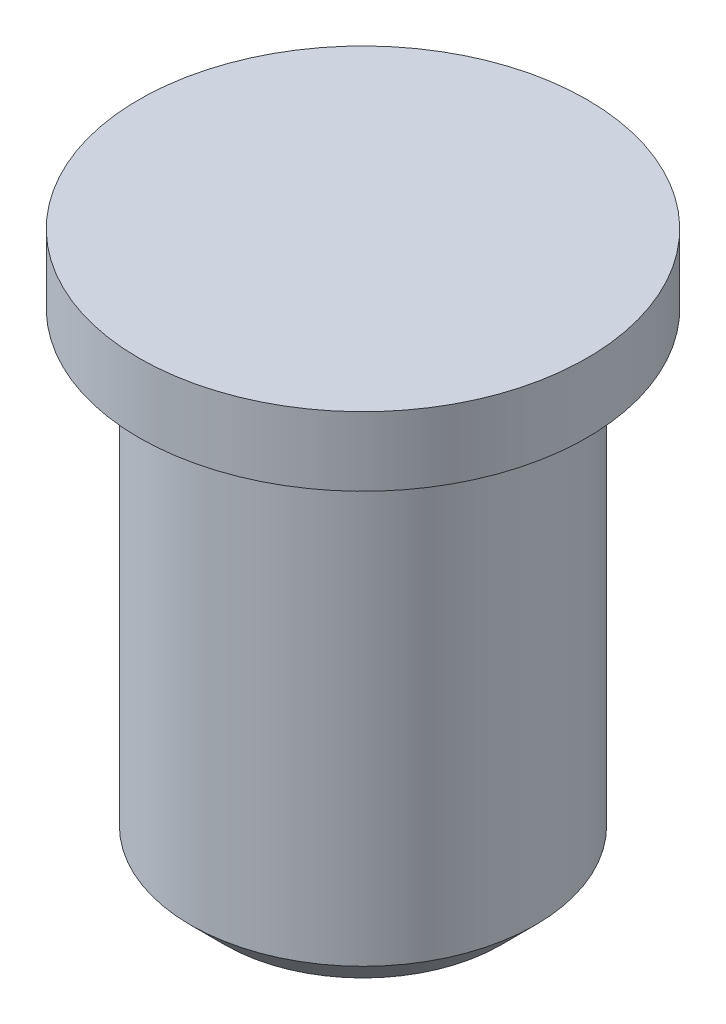
ISO-10303-21;
HEADER;
FILE_DESCRIPTION(('STEP AP214'),'2;1');
FILE_NAME('part.step','',(''),(''),'','','');
FILE_SCHEMA(('AUTOMOTIVE_DESIGN { 1 0 10303 214 1 1 1 1 }'));
ENDSEC;
DATA;
#1=APPLICATION_CONTEXT('core data for automotive mechanical design processes');
#2=APPLICATION_PROTOCOL_DEFINITION('international standard','automotive_design',2000,#1);
#3=PRODUCT_CONTEXT('',#1,'mechanical');
#4=PRODUCT('Part','Part','',(#3));
#5=PRODUCT_RELATED_PRODUCT_CATEGORY('part','',(#4));
#6=PRODUCT_DEFINITION_FORMATION('','',#4);
#7=PRODUCT_DEFINITION_CONTEXT('part definition',#1,'design');
#8=PRODUCT_DEFINITION('design','',#6,#7);
#9=PRODUCT_DEFINITION_SHAPE('','',#8);
#10=(LENGTH_UNIT() NAMED_UNIT(*) SI_UNIT(.MILLI.,.METRE.));
#11=(NAMED_UNIT(*) PLANE_ANGLE_UNIT() SI_UNIT($,.RADIAN.));
#12=(NAMED_UNIT(*) SI_UNIT($,.STERADIAN.) SOLID_ANGLE_UNIT());
#13=UNCERTAINTY_MEASURE_WITH_UNIT(LENGTH_MEASURE(1.E-05),#10,'distance_accuracy_value','');
#14=(GEOMETRIC_REPRESENTATION_CONTEXT(3) GLOBAL_UNCERTAINTY_ASSIGNED_CONTEXT((#13)) GLOBAL_UNIT_ASSIGNED_CONTEXT((#10,
#11,#12)) REPRESENTATION_CONTEXT('',''));
#15=CARTESIAN_POINT('',(0.,0.,0.));
#16=DIRECTION('',(0.,0.,1.));
#17=DIRECTION('',(1.,0.,0.));
#18=AXIS2_PLACEMENT_3D('',#15,#16,#17);
#19=CARTESIAN_POINT('',(0.,0.,0.));
#20=DIRECTION('',(0.,-1.,0.));
#21=DIRECTION('',(0.,0.,-1.));
#22=AXIS2_PLACEMENT_3D('',#19,#20,#21);
#23=PLANE('',#22);
#24=CARTESIAN_POINT('',(0.,0.,0.));
#25=DIRECTION('',(0.,1.,0.));
#26=DIRECTION('',(0.,0.,1.));
#27=AXIS2_PLACEMENT_3D('',#24,#25,#26);
#28=CIRCLE('',#27,3.25);
#29=CARTESIAN_POINT('',(0.,0.,3.25));
#30=VERTEX_POINT('',#29);
#31=EDGE_CURVE('E43',#30,#30,#28,.T.);
#32=ORIENTED_EDGE('',*,*,#31,.T.);
#33=EDGE_LOOP('',(#32));
#34=FACE_BOUND('',#33,.T.);
#35=ADVANCED_FACE('F32',(#34),#23,.F.);
#36=CARTESIAN_POINT('',(0.,0.,0.));
#37=DIRECTION('',(0.,1.,0.));
#38=DIRECTION('',(0.,0.,1.));
#39=AXIS2_PLACEMENT_3D('',#36,#37,#38);
#40=CYLINDRICAL_SURFACE('',#39,3.25);
#41=ORIENTED_EDGE('',*,*,#31,.F.);
#42=EDGE_LOOP('',(#41));
#43=FACE_BOUND('',#42,.T.);
#44=CARTESIAN_POINT('',(0.,-1.,0.));
#45=DIRECTION('',(0.,1.,0.));
#46=DIRECTION('',(0.,0.,1.));
#47=AXIS2_PLACEMENT_3D('',#44,#45,#46);
#48=CIRCLE('',#47,3.25);
#49=CARTESIAN_POINT('',(0.,-1.,3.25));
#50=VERTEX_POINT('',#49);
#51=EDGE_CURVE('E47',#50,#50,#48,.T.);
#52=ORIENTED_EDGE('',*,*,#51,.T.);
#53=EDGE_LOOP('',(#52));
#54=FACE_BOUND('',#53,.T.);
#55=ADVANCED_FACE('F67',(#43,#54),#40,.T.);
#56=CARTESIAN_POINT('',(3.25,-1.,0.));
#57=DIRECTION('',(0.,1.,0.));
#58=DIRECTION('',(0.,0.,1.));
#59=AXIS2_PLACEMENT_3D('',#56,#57,#58);
#60=PLANE('',#59);
#61=ORIENTED_EDGE('',*,*,#51,.F.);
#62=EDGE_LOOP('',(#61));
#63=FACE_BOUND('',#62,.T.);
#64=CARTESIAN_POINT('',(0.,-1.,0.));
#65=DIRECTION('',(0.,1.,0.));
#66=DIRECTION('',(0.,0.,1.));
#67=AXIS2_PLACEMENT_3D('',#64,#65,#66);
#68=CIRCLE('',#67,2.5);
#69=CARTESIAN_POINT('',(0.,-1.,2.5));
#70=VERTEX_POINT('',#69);
#71=EDGE_CURVE('E52',#70,#70,#68,.T.);
#72=ORIENTED_EDGE('',*,*,#71,.T.);
#73=EDGE_LOOP('',(#72));
#74=FACE_BOUND('',#73,.T.);
#75=ADVANCED_FACE('F56',(#63,#74),#60,.F.);
#76=CARTESIAN_POINT('',(0.,0.,0.));
#77=DIRECTION('',(0.,1.,0.));
#78=DIRECTION('',(0.,0.,1.));
#79=AXIS2_PLACEMENT_3D('',#76,#77,#78);
#80=CYLINDRICAL_SURFACE('',#79,2.5);
#81=CARTESIAN_POINT('',(0.,-7.5,0.));
#82=DIRECTION('',(0.,1.,0.));
#83=DIRECTION('',(0.,0.,1.));
#84=AXIS2_PLACEMENT_3D('',#81,#82,#83);
#85=CIRCLE('',#84,2.5);
#86=CARTESIAN_POINT('',(0.,-7.5,2.5));
#87=VERTEX_POINT('',#86);
#88=EDGE_CURVE('E39',#87,#87,#85,.T.);
#89=ORIENTED_EDGE('',*,*,#88,.T.);
#90=EDGE_LOOP('',(#89));
#91=FACE_BOUND('',#90,.T.);
#92=ORIENTED_EDGE('',*,*,#71,.F.);
#93=EDGE_LOOP('',(#92));
#94=FACE_BOUND('',#93,.T.);
#95=ADVANCED_FACE('F58',(#91,#94),#80,.T.);
#96=CARTESIAN_POINT('',(2.5,-8.,0.));
#97=DIRECTION('',(0.,1.,0.));
#98=DIRECTION('',(0.,0.,1.));
#99=AXIS2_PLACEMENT_3D('',#96,#97,#98);
#100=PLANE('',#99);
#101=CARTESIAN_POINT('',(0.,-8.,0.));
#102=DIRECTION('',(0.,1.,0.));
#103=DIRECTION('',(0.,0.,1.));
#104=AXIS2_PLACEMENT_3D('',#101,#102,#103);
#105=CIRCLE('',#104,2.);
#106=CARTESIAN_POINT('',(0.,-8.,2.));
#107=VERTEX_POINT('',#106);
#108=EDGE_CURVE('E10',#107,#107,#105,.F.);
#109=ORIENTED_EDGE('',*,*,#108,.T.);
#110=EDGE_LOOP('',(#109));
#111=FACE_BOUND('',#110,.T.);
#112=ADVANCED_FACE('F60',(#111),#100,.F.);
#113=CARTESIAN_POINT('',(0.,-7.5,0.));
#114=DIRECTION('',(0.,1.,0.));
#115=DIRECTION('',(0.,0.,1.));
#116=AXIS2_PLACEMENT_3D('',#113,#114,#115);
#117=CONICAL_SURFACE('',#116,2.5,0.785398163397449);
#118=ORIENTED_EDGE('',*,*,#108,.F.);
#119=EDGE_LOOP('',(#118));
#120=FACE_BOUND('',#119,.T.);
#121=ORIENTED_EDGE('',*,*,#88,.F.);
#122=EDGE_LOOP('',(#121));
#123=FACE_BOUND('',#122,.T.);
#124=ADVANCED_FACE('F34',(#120,#123),#117,.T.);
#125=CLOSED_SHELL('',(#35,#55,#75,#95,#112,#124));
#126=MANIFOLD_SOLID_BREP('B2',#125);
#127=ADVANCED_BREP_SHAPE_REPRESENTATION('',(#18,#126),#14);
#128=SHAPE_DEFINITION_REPRESENTATION(#9,#127);
ENDSEC;
END-ISO-10303-21;
